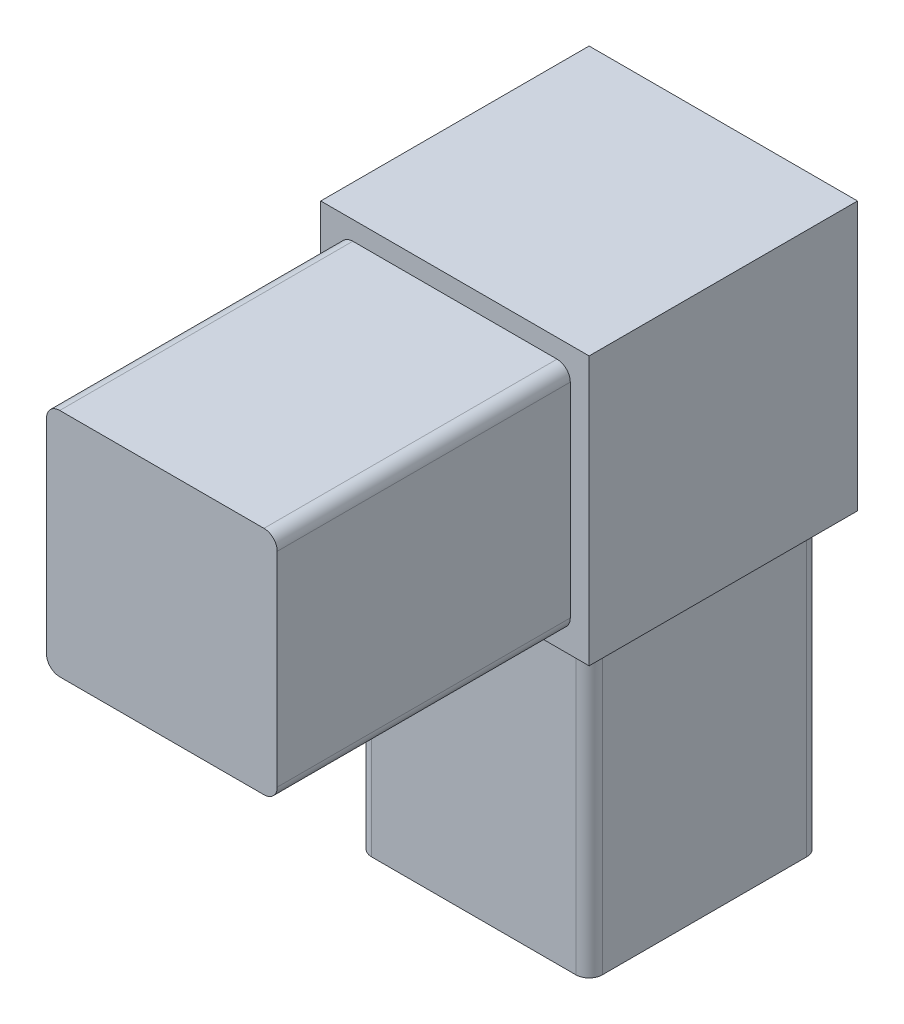
ISO-10303-21;
HEADER;
FILE_DESCRIPTION(('STEP AP214'),'2;1');
FILE_NAME('part.step','',(''),(''),'','','');
FILE_SCHEMA(('AUTOMOTIVE_DESIGN { 1 0 10303 214 1 1 1 1 }'));
ENDSEC;
DATA;
#1=APPLICATION_CONTEXT('core data for automotive mechanical design processes');
#2=APPLICATION_PROTOCOL_DEFINITION('international standard','automotive_design',2000,#1);
#3=PRODUCT_CONTEXT('',#1,'mechanical');
#4=PRODUCT('Part','Part','',(#3));
#5=PRODUCT_RELATED_PRODUCT_CATEGORY('part','',(#4));
#6=PRODUCT_DEFINITION_FORMATION('','',#4);
#7=PRODUCT_DEFINITION_CONTEXT('part definition',#1,'design');
#8=PRODUCT_DEFINITION('design','',#6,#7);
#9=PRODUCT_DEFINITION_SHAPE('','',#8);
#10=(LENGTH_UNIT() NAMED_UNIT(*) SI_UNIT(.MILLI.,.METRE.));
#11=(NAMED_UNIT(*) PLANE_ANGLE_UNIT() SI_UNIT($,.RADIAN.));
#12=(NAMED_UNIT(*) SI_UNIT($,.STERADIAN.) SOLID_ANGLE_UNIT());
#13=UNCERTAINTY_MEASURE_WITH_UNIT(LENGTH_MEASURE(1.E-05),#10,'distance_accuracy_value','');
#14=(GEOMETRIC_REPRESENTATION_CONTEXT(3) GLOBAL_UNCERTAINTY_ASSIGNED_CONTEXT((#13)) GLOBAL_UNIT_ASSIGNED_CONTEXT((#10,
#11,#12)) REPRESENTATION_CONTEXT('',''));
#15=CARTESIAN_POINT('',(0.,0.,0.));
#16=DIRECTION('',(0.,0.,1.));
#17=DIRECTION('',(1.,0.,0.));
#18=AXIS2_PLACEMENT_3D('',#15,#16,#17);
#19=CARTESIAN_POINT('',(-12.8524,53.7718,12.8524));
#20=DIRECTION('',(0.,0.,-1.));
#21=DIRECTION('',(-1.,0.,0.));
#22=AXIS2_PLACEMENT_3D('',#19,#20,#21);
#23=PLANE('',#22);
#24=DIRECTION('',(1.,0.,0.));
#25=VECTOR('',#24,1.);
#26=CARTESIAN_POINT('',(-12.8524,28.067,12.8524));
#27=LINE('',#26,#25);
#28=CARTESIAN_POINT('',(-12.8524,28.067,12.8524));
#29=VERTEX_POINT('',#28);
#30=CARTESIAN_POINT('',(12.8524,28.067,12.8524));
#31=VERTEX_POINT('',#30);
#32=EDGE_CURVE('E192',#29,#31,#27,.T.);
#33=ORIENTED_EDGE('',*,*,#32,.T.);
#34=DIRECTION('',(0.,-1.,0.));
#35=VECTOR('',#34,1.);
#36=CARTESIAN_POINT('',(12.8524,53.7718,12.8524));
#37=LINE('',#36,#35);
#38=CARTESIAN_POINT('',(12.8524,53.7718,12.8524));
#39=VERTEX_POINT('',#38);
#40=EDGE_CURVE('E412',#39,#31,#37,.T.);
#41=ORIENTED_EDGE('',*,*,#40,.F.);
#42=DIRECTION('',(1.,0.,0.));
#43=VECTOR('',#42,1.);
#44=CARTESIAN_POINT('',(-12.8524,53.7718,12.8524));
#45=LINE('',#44,#43);
#46=CARTESIAN_POINT('',(-12.8524,53.7718,12.8524));
#47=VERTEX_POINT('',#46);
#48=EDGE_CURVE('E188',#47,#39,#45,.T.);
#49=ORIENTED_EDGE('',*,*,#48,.F.);
#50=DIRECTION('',(0.,-1.,0.));
#51=VECTOR('',#50,1.);
#52=CARTESIAN_POINT('',(-12.8524,53.7718,12.8524));
#53=LINE('',#52,#51);
#54=EDGE_CURVE('E202',#47,#29,#53,.T.);
#55=ORIENTED_EDGE('',*,*,#54,.T.);
#56=EDGE_LOOP('',(#33,#41,#49,#55));
#57=FACE_BOUND('',#56,.T.);
#58=DIRECTION('',(0.,1.,0.));
#59=VECTOR('',#58,1.);
#60=CARTESIAN_POINT('',(11.049,29.8704,12.8524));
#61=LINE('',#60,#59);
#62=CARTESIAN_POINT('',(11.049,31.1404,12.8524));
#63=VERTEX_POINT('',#62);
#64=CARTESIAN_POINT('',(11.049,50.6984,12.8524));
#65=VERTEX_POINT('',#64);
#66=EDGE_CURVE('E399',#63,#65,#61,.T.);
#67=ORIENTED_EDGE('',*,*,#66,.F.);
#68=CARTESIAN_POINT('',(9.779,31.1404,12.8524));
#69=DIRECTION('',(0.,0.,-1.));
#70=DIRECTION('',(-1.,0.,0.));
#71=AXIS2_PLACEMENT_3D('',#68,#69,#70);
#72=CIRCLE('',#71,1.27);
#73=CARTESIAN_POINT('',(9.779,29.8704,12.8524));
#74=VERTEX_POINT('',#73);
#75=EDGE_CURVE('E280',#63,#74,#72,.T.);
#76=ORIENTED_EDGE('',*,*,#75,.T.);
#77=DIRECTION('',(1.,0.,0.));
#78=VECTOR('',#77,1.);
#79=CARTESIAN_POINT('',(-11.049,29.8704,12.8524));
#80=LINE('',#79,#78);
#81=CARTESIAN_POINT('',(-9.779,29.8704,12.8524));
#82=VERTEX_POINT('',#81);
#83=EDGE_CURVE('E407',#82,#74,#80,.T.);
#84=ORIENTED_EDGE('',*,*,#83,.F.);
#85=CARTESIAN_POINT('',(-9.779,31.1404,12.8524));
#86=DIRECTION('',(0.,0.,-1.));
#87=DIRECTION('',(-1.,0.,0.));
#88=AXIS2_PLACEMENT_3D('',#85,#86,#87);
#89=CIRCLE('',#88,1.27);
#90=CARTESIAN_POINT('',(-11.049,31.1404,12.8524));
#91=VERTEX_POINT('',#90);
#92=EDGE_CURVE('E284',#82,#91,#89,.T.);
#93=ORIENTED_EDGE('',*,*,#92,.T.);
#94=DIRECTION('',(0.,-1.,0.));
#95=VECTOR('',#94,1.);
#96=CARTESIAN_POINT('',(-11.049,29.8704,12.8524));
#97=LINE('',#96,#95);
#98=CARTESIAN_POINT('',(-11.049,50.6984,12.8524));
#99=VERTEX_POINT('',#98);
#100=EDGE_CURVE('E405',#99,#91,#97,.T.);
#101=ORIENTED_EDGE('',*,*,#100,.F.);
#102=CARTESIAN_POINT('',(-9.779,50.6984,12.8524));
#103=DIRECTION('',(0.,0.,-1.));
#104=DIRECTION('',(-1.,0.,0.));
#105=AXIS2_PLACEMENT_3D('',#102,#103,#104);
#106=CIRCLE('',#105,1.27);
#107=CARTESIAN_POINT('',(-9.779,51.9684,12.8524));
#108=VERTEX_POINT('',#107);
#109=EDGE_CURVE('E282',#99,#108,#106,.T.);
#110=ORIENTED_EDGE('',*,*,#109,.T.);
#111=DIRECTION('',(-1.,0.,0.));
#112=VECTOR('',#111,1.);
#113=CARTESIAN_POINT('',(-11.049,51.9684,12.8524));
#114=LINE('',#113,#112);
#115=CARTESIAN_POINT('',(9.779,51.9684,12.8524));
#116=VERTEX_POINT('',#115);
#117=EDGE_CURVE('E402',#116,#108,#114,.T.);
#118=ORIENTED_EDGE('',*,*,#117,.F.);
#119=CARTESIAN_POINT('',(9.779,50.6984,12.8524));
#120=DIRECTION('',(0.,0.,-1.));
#121=DIRECTION('',(-1.,0.,0.));
#122=AXIS2_PLACEMENT_3D('',#119,#120,#121);
#123=CIRCLE('',#122,1.27);
#124=EDGE_CURVE('E278',#116,#65,#123,.T.);
#125=ORIENTED_EDGE('',*,*,#124,.T.);
#126=EDGE_LOOP('',(#67,#76,#84,#93,#101,#110,#118,#125));
#127=FACE_BOUND('',#126,.T.);
#128=ADVANCED_FACE('F35',(#57,#127),#23,.F.);
#129=CARTESIAN_POINT('',(11.049,28.067,-11.049));
#130=DIRECTION('',(-1.,0.,0.));
#131=DIRECTION('',(0.,0.,1.));
#132=AXIS2_PLACEMENT_3D('',#129,#130,#131);
#133=PLANE('',#132);
#134=DIRECTION('',(0.,0.,-1.));
#135=VECTOR('',#134,1.);
#136=CARTESIAN_POINT('',(11.049,28.067,-11.049));
#137=LINE('',#136,#135);
#138=CARTESIAN_POINT('',(11.049,28.067,9.779));
#139=VERTEX_POINT('',#138);
#140=CARTESIAN_POINT('',(11.049,28.067,-9.779));
#141=VERTEX_POINT('',#140);
#142=EDGE_CURVE('E206',#139,#141,#137,.T.);
#143=ORIENTED_EDGE('',*,*,#142,.F.);
#144=DIRECTION('',(0.,-1.,0.));
#145=VECTOR('',#144,1.);
#146=CARTESIAN_POINT('',(11.049,28.067,9.779));
#147=LINE('',#146,#145);
#148=CARTESIAN_POINT('',(11.049,0.,9.779));
#149=VERTEX_POINT('',#148);
#150=EDGE_CURVE('E271',#139,#149,#147,.T.);
#151=ORIENTED_EDGE('',*,*,#150,.T.);
#152=DIRECTION('',(0.,0.,-1.));
#153=VECTOR('',#152,1.);
#154=CARTESIAN_POINT('',(11.049,0.,-11.049));
#155=LINE('',#154,#153);
#156=CARTESIAN_POINT('',(11.049,0.,-9.779));
#157=VERTEX_POINT('',#156);
#158=EDGE_CURVE('E197',#149,#157,#155,.T.);
#159=ORIENTED_EDGE('',*,*,#158,.T.);
#160=DIRECTION('',(0.,-1.,0.));
#161=VECTOR('',#160,1.);
#162=CARTESIAN_POINT('',(11.049,28.067,-9.779));
#163=LINE('',#162,#161);
#164=EDGE_CURVE('E269',#157,#141,#163,.F.);
#165=ORIENTED_EDGE('',*,*,#164,.T.);
#166=EDGE_LOOP('',(#143,#151,#159,#165));
#167=FACE_BOUND('',#166,.T.);
#168=ADVANCED_FACE('F311',(#167),#133,.F.);
#169=CARTESIAN_POINT('',(-11.049,28.067,-11.049));
#170=DIRECTION('',(0.,0.,1.));
#171=DIRECTION('',(1.,0.,0.));
#172=AXIS2_PLACEMENT_3D('',#169,#170,#171);
#173=PLANE('',#172);
#174=DIRECTION('',(-1.,0.,0.));
#175=VECTOR('',#174,1.);
#176=CARTESIAN_POINT('',(-11.049,0.,-11.049));
#177=LINE('',#176,#175);
#178=CARTESIAN_POINT('',(9.779,0.,-11.049));
#179=VERTEX_POINT('',#178);
#180=CARTESIAN_POINT('',(-9.779,0.,-11.049));
#181=VERTEX_POINT('',#180);
#182=EDGE_CURVE('E200',#179,#181,#177,.T.);
#183=ORIENTED_EDGE('',*,*,#182,.T.);
#184=DIRECTION('',(0.,-1.,0.));
#185=VECTOR('',#184,1.);
#186=CARTESIAN_POINT('',(-9.779,28.067,-11.049));
#187=LINE('',#186,#185);
#188=CARTESIAN_POINT('',(-9.779,28.067,-11.049));
#189=VERTEX_POINT('',#188);
#190=EDGE_CURVE('E50',#181,#189,#187,.F.);
#191=ORIENTED_EDGE('',*,*,#190,.T.);
#192=DIRECTION('',(-1.,0.,0.));
#193=VECTOR('',#192,1.);
#194=CARTESIAN_POINT('',(-11.049,28.067,-11.049));
#195=LINE('',#194,#193);
#196=CARTESIAN_POINT('',(9.779,28.067,-11.049));
#197=VERTEX_POINT('',#196);
#198=EDGE_CURVE('E208',#197,#189,#195,.T.);
#199=ORIENTED_EDGE('',*,*,#198,.F.);
#200=DIRECTION('',(0.,-1.,0.));
#201=VECTOR('',#200,1.);
#202=CARTESIAN_POINT('',(9.779,28.067,-11.049));
#203=LINE('',#202,#201);
#204=EDGE_CURVE('E274',#197,#179,#203,.T.);
#205=ORIENTED_EDGE('',*,*,#204,.T.);
#206=EDGE_LOOP('',(#183,#191,#199,#205));
#207=FACE_BOUND('',#206,.T.);
#208=ADVANCED_FACE('F304',(#207),#173,.F.);
#209=CARTESIAN_POINT('',(-11.049,28.067,-11.049));
#210=DIRECTION('',(1.,0.,0.));
#211=DIRECTION('',(0.,0.,-1.));
#212=AXIS2_PLACEMENT_3D('',#209,#210,#211);
#213=PLANE('',#212);
#214=DIRECTION('',(0.,0.,1.));
#215=VECTOR('',#214,1.);
#216=CARTESIAN_POINT('',(-11.049,0.,-11.049));
#217=LINE('',#216,#215);
#218=CARTESIAN_POINT('',(-11.049,0.,-9.779));
#219=VERTEX_POINT('',#218);
#220=CARTESIAN_POINT('',(-11.049,0.,9.779));
#221=VERTEX_POINT('',#220);
#222=EDGE_CURVE('E219',#219,#221,#217,.T.);
#223=ORIENTED_EDGE('',*,*,#222,.T.);
#224=DIRECTION('',(0.,-1.,0.));
#225=VECTOR('',#224,1.);
#226=CARTESIAN_POINT('',(-11.049,28.067,9.779));
#227=LINE('',#226,#225);
#228=CARTESIAN_POINT('',(-11.049,28.067,9.779));
#229=VERTEX_POINT('',#228);
#230=EDGE_CURVE('E267',#221,#229,#227,.F.);
#231=ORIENTED_EDGE('',*,*,#230,.T.);
#232=DIRECTION('',(0.,0.,1.));
#233=VECTOR('',#232,1.);
#234=CARTESIAN_POINT('',(-11.049,28.067,-11.049));
#235=LINE('',#234,#233);
#236=CARTESIAN_POINT('',(-11.049,28.067,-9.779));
#237=VERTEX_POINT('',#236);
#238=EDGE_CURVE('E211',#237,#229,#235,.T.);
#239=ORIENTED_EDGE('',*,*,#238,.F.);
#240=DIRECTION('',(0.,-1.,0.));
#241=VECTOR('',#240,1.);
#242=CARTESIAN_POINT('',(-11.049,28.067,-9.779));
#243=LINE('',#242,#241);
#244=EDGE_CURVE('E264',#237,#219,#243,.T.);
#245=ORIENTED_EDGE('',*,*,#244,.T.);
#246=EDGE_LOOP('',(#223,#231,#239,#245));
#247=FACE_BOUND('',#246,.T.);
#248=ADVANCED_FACE('F296',(#247),#213,.F.);
#249=CARTESIAN_POINT('',(-11.049,28.067,11.049));
#250=DIRECTION('',(0.,0.,-1.));
#251=DIRECTION('',(-1.,0.,0.));
#252=AXIS2_PLACEMENT_3D('',#249,#250,#251);
#253=PLANE('',#252);
#254=DIRECTION('',(1.,0.,0.));
#255=VECTOR('',#254,1.);
#256=CARTESIAN_POINT('',(-11.049,28.067,11.049));
#257=LINE('',#256,#255);
#258=CARTESIAN_POINT('',(-9.779,28.067,11.049));
#259=VERTEX_POINT('',#258);
#260=CARTESIAN_POINT('',(9.779,28.067,11.049));
#261=VERTEX_POINT('',#260);
#262=EDGE_CURVE('E214',#259,#261,#257,.T.);
#263=ORIENTED_EDGE('',*,*,#262,.F.);
#264=DIRECTION('',(0.,-1.,0.));
#265=VECTOR('',#264,1.);
#266=CARTESIAN_POINT('',(-9.779,28.067,11.049));
#267=LINE('',#266,#265);
#268=CARTESIAN_POINT('',(-9.779,0.,11.049));
#269=VERTEX_POINT('',#268);
#270=EDGE_CURVE('E253',#259,#269,#267,.T.);
#271=ORIENTED_EDGE('',*,*,#270,.T.);
#272=DIRECTION('',(1.,0.,0.));
#273=VECTOR('',#272,1.);
#274=CARTESIAN_POINT('',(-11.049,0.,11.049));
#275=LINE('',#274,#273);
#276=CARTESIAN_POINT('',(9.779,0.,11.049));
#277=VERTEX_POINT('',#276);
#278=EDGE_CURVE('E209',#269,#277,#275,.T.);
#279=ORIENTED_EDGE('',*,*,#278,.T.);
#280=DIRECTION('',(0.,-1.,0.));
#281=VECTOR('',#280,1.);
#282=CARTESIAN_POINT('',(9.779,28.067,11.049));
#283=LINE('',#282,#281);
#284=EDGE_CURVE('E251',#277,#261,#283,.F.);
#285=ORIENTED_EDGE('',*,*,#284,.T.);
#286=EDGE_LOOP('',(#263,#271,#279,#285));
#287=FACE_BOUND('',#286,.T.);
#288=ADVANCED_FACE('F319',(#287),#253,.F.);
#289=CARTESIAN_POINT('',(0.,0.,0.));
#290=DIRECTION('',(0.,1.,0.));
#291=DIRECTION('',(0.,0.,1.));
#292=AXIS2_PLACEMENT_3D('',#289,#290,#291);
#293=PLANE('',#292);
#294=ORIENTED_EDGE('',*,*,#278,.F.);
#295=CARTESIAN_POINT('',(-9.779,0.,9.779));
#296=DIRECTION('',(0.,1.,0.));
#297=DIRECTION('',(0.,0.,1.));
#298=AXIS2_PLACEMENT_3D('',#295,#296,#297);
#299=CIRCLE('',#298,1.27);
#300=EDGE_CURVE('E262',#269,#221,#299,.F.);
#301=ORIENTED_EDGE('',*,*,#300,.T.);
#302=ORIENTED_EDGE('',*,*,#222,.F.);
#303=CARTESIAN_POINT('',(-9.779,0.,-9.779));
#304=DIRECTION('',(0.,1.,0.));
#305=DIRECTION('',(0.,0.,1.));
#306=AXIS2_PLACEMENT_3D('',#303,#304,#305);
#307=CIRCLE('',#306,1.27);
#308=EDGE_CURVE('E258',#219,#181,#307,.F.);
#309=ORIENTED_EDGE('',*,*,#308,.T.);
#310=ORIENTED_EDGE('',*,*,#182,.F.);
#311=CARTESIAN_POINT('',(9.779,0.,-9.779));
#312=DIRECTION('',(0.,1.,0.));
#313=DIRECTION('',(0.,0.,1.));
#314=AXIS2_PLACEMENT_3D('',#311,#312,#313);
#315=CIRCLE('',#314,1.27);
#316=EDGE_CURVE('E256',#179,#157,#315,.F.);
#317=ORIENTED_EDGE('',*,*,#316,.T.);
#318=ORIENTED_EDGE('',*,*,#158,.F.);
#319=CARTESIAN_POINT('',(9.779,0.,9.779));
#320=DIRECTION('',(0.,1.,0.));
#321=DIRECTION('',(0.,0.,1.));
#322=AXIS2_PLACEMENT_3D('',#319,#320,#321);
#323=CIRCLE('',#322,1.27);
#324=EDGE_CURVE('E260',#149,#277,#323,.F.);
#325=ORIENTED_EDGE('',*,*,#324,.T.);
#326=EDGE_LOOP('',(#294,#301,#302,#309,#310,#317,#318,#325));
#327=FACE_BOUND('',#326,.T.);
#328=ADVANCED_FACE('F303',(#327),#293,.F.);
#329=CARTESIAN_POINT('',(0.,28.067,0.));
#330=DIRECTION('',(0.,-1.,0.));
#331=DIRECTION('',(0.,0.,-1.));
#332=AXIS2_PLACEMENT_3D('',#329,#330,#331);
#333=PLANE('',#332);
#334=DIRECTION('',(0.,0.,-1.));
#335=VECTOR('',#334,1.);
#336=CARTESIAN_POINT('',(12.8524,28.067,12.8524));
#337=LINE('',#336,#335);
#338=CARTESIAN_POINT('',(12.8524,28.067,-12.8524));
#339=VERTEX_POINT('',#338);
#340=EDGE_CURVE('E196',#31,#339,#337,.T.);
#341=ORIENTED_EDGE('',*,*,#340,.F.);
#342=ORIENTED_EDGE('',*,*,#32,.F.);
#343=DIRECTION('',(0.,0.,1.));
#344=VECTOR('',#343,1.);
#345=CARTESIAN_POINT('',(-12.8524,28.067,12.8524));
#346=LINE('',#345,#344);
#347=CARTESIAN_POINT('',(-12.8524,28.067,-12.8524));
#348=VERTEX_POINT('',#347);
#349=EDGE_CURVE('E416',#348,#29,#346,.T.);
#350=ORIENTED_EDGE('',*,*,#349,.F.);
#351=DIRECTION('',(-1.,0.,0.));
#352=VECTOR('',#351,1.);
#353=CARTESIAN_POINT('',(-12.8524,28.067,-12.8524));
#354=LINE('',#353,#352);
#355=EDGE_CURVE('E414',#339,#348,#354,.T.);
#356=ORIENTED_EDGE('',*,*,#355,.F.);
#357=EDGE_LOOP('',(#341,#342,#350,#356));
#358=FACE_BOUND('',#357,.T.);
#359=ORIENTED_EDGE('',*,*,#262,.T.);
#360=CARTESIAN_POINT('',(9.779,28.067,9.779));
#361=DIRECTION('',(0.,-1.,0.));
#362=DIRECTION('',(0.,0.,-1.));
#363=AXIS2_PLACEMENT_3D('',#360,#361,#362);
#364=CIRCLE('',#363,1.27);
#365=EDGE_CURVE('E288',#261,#139,#364,.F.);
#366=ORIENTED_EDGE('',*,*,#365,.T.);
#367=ORIENTED_EDGE('',*,*,#142,.T.);
#368=CARTESIAN_POINT('',(9.779,28.067,-9.779));
#369=DIRECTION('',(0.,-1.,0.));
#370=DIRECTION('',(0.,0.,-1.));
#371=AXIS2_PLACEMENT_3D('',#368,#369,#370);
#372=CIRCLE('',#371,1.27);
#373=EDGE_CURVE('E11',#141,#197,#372,.F.);
#374=ORIENTED_EDGE('',*,*,#373,.T.);
#375=ORIENTED_EDGE('',*,*,#198,.T.);
#376=CARTESIAN_POINT('',(-9.779,28.067,-9.779));
#377=DIRECTION('',(0.,-1.,0.));
#378=DIRECTION('',(0.,0.,-1.));
#379=AXIS2_PLACEMENT_3D('',#376,#377,#378);
#380=CIRCLE('',#379,1.27);
#381=EDGE_CURVE('E43',#189,#237,#380,.F.);
#382=ORIENTED_EDGE('',*,*,#381,.T.);
#383=ORIENTED_EDGE('',*,*,#238,.T.);
#384=CARTESIAN_POINT('',(-9.779,28.067,9.779));
#385=DIRECTION('',(0.,-1.,0.));
#386=DIRECTION('',(0.,0.,-1.));
#387=AXIS2_PLACEMENT_3D('',#384,#385,#386);
#388=CIRCLE('',#387,1.27);
#389=EDGE_CURVE('E286',#229,#259,#388,.F.);
#390=ORIENTED_EDGE('',*,*,#389,.T.);
#391=EDGE_LOOP('',(#359,#366,#367,#374,#375,#382,#383,#390));
#392=FACE_BOUND('',#391,.T.);
#393=ADVANCED_FACE('F291',(#358,#392),#333,.T.);
#394=CARTESIAN_POINT('',(12.8524,53.7718,12.8524));
#395=DIRECTION('',(-1.,0.,0.));
#396=DIRECTION('',(0.,0.,1.));
#397=AXIS2_PLACEMENT_3D('',#394,#395,#396);
#398=PLANE('',#397);
#399=ORIENTED_EDGE('',*,*,#340,.T.);
#400=DIRECTION('',(0.,-1.,0.));
#401=VECTOR('',#400,1.);
#402=CARTESIAN_POINT('',(12.8524,53.7718,-12.8524));
#403=LINE('',#402,#401);
#404=CARTESIAN_POINT('',(12.8524,53.7718,-12.8524));
#405=VERTEX_POINT('',#404);
#406=EDGE_CURVE('E176',#405,#339,#403,.T.);
#407=ORIENTED_EDGE('',*,*,#406,.F.);
#408=DIRECTION('',(0.,0.,-1.));
#409=VECTOR('',#408,1.);
#410=CARTESIAN_POINT('',(12.8524,53.7718,12.8524));
#411=LINE('',#410,#409);
#412=EDGE_CURVE('E183',#39,#405,#411,.T.);
#413=ORIENTED_EDGE('',*,*,#412,.F.);
#414=ORIENTED_EDGE('',*,*,#40,.T.);
#415=EDGE_LOOP('',(#399,#407,#413,#414));
#416=FACE_BOUND('',#415,.T.);
#417=ADVANCED_FACE('F194',(#416),#398,.F.);
#418=CARTESIAN_POINT('',(-12.8524,53.7718,-12.8524));
#419=DIRECTION('',(0.,0.,1.));
#420=DIRECTION('',(1.,0.,0.));
#421=AXIS2_PLACEMENT_3D('',#418,#419,#420);
#422=PLANE('',#421);
#423=ORIENTED_EDGE('',*,*,#355,.T.);
#424=DIRECTION('',(0.,-1.,0.));
#425=VECTOR('',#424,1.);
#426=CARTESIAN_POINT('',(-12.8524,53.7718,-12.8524));
#427=LINE('',#426,#425);
#428=CARTESIAN_POINT('',(-12.8524,53.7718,-12.8524));
#429=VERTEX_POINT('',#428);
#430=EDGE_CURVE('E179',#429,#348,#427,.T.);
#431=ORIENTED_EDGE('',*,*,#430,.F.);
#432=DIRECTION('',(-1.,0.,0.));
#433=VECTOR('',#432,1.);
#434=CARTESIAN_POINT('',(-12.8524,53.7718,-12.8524));
#435=LINE('',#434,#433);
#436=EDGE_CURVE('E172',#405,#429,#435,.T.);
#437=ORIENTED_EDGE('',*,*,#436,.F.);
#438=ORIENTED_EDGE('',*,*,#406,.T.);
#439=EDGE_LOOP('',(#423,#431,#437,#438));
#440=FACE_BOUND('',#439,.T.);
#441=ADVANCED_FACE('F174',(#440),#422,.F.);
#442=CARTESIAN_POINT('',(-12.8524,53.7718,12.8524));
#443=DIRECTION('',(1.,0.,0.));
#444=DIRECTION('',(0.,0.,-1.));
#445=AXIS2_PLACEMENT_3D('',#442,#443,#444);
#446=PLANE('',#445);
#447=ORIENTED_EDGE('',*,*,#349,.T.);
#448=ORIENTED_EDGE('',*,*,#54,.F.);
#449=DIRECTION('',(0.,0.,1.));
#450=VECTOR('',#449,1.);
#451=CARTESIAN_POINT('',(-12.8524,53.7718,12.8524));
#452=LINE('',#451,#450);
#453=EDGE_CURVE('E182',#429,#47,#452,.T.);
#454=ORIENTED_EDGE('',*,*,#453,.F.);
#455=ORIENTED_EDGE('',*,*,#430,.T.);
#456=EDGE_LOOP('',(#447,#448,#454,#455));
#457=FACE_BOUND('',#456,.T.);
#458=ADVANCED_FACE('F345',(#457),#446,.F.);
#459=CARTESIAN_POINT('',(0.,53.7718,0.));
#460=DIRECTION('',(0.,-1.,0.));
#461=DIRECTION('',(0.,0.,-1.));
#462=AXIS2_PLACEMENT_3D('',#459,#460,#461);
#463=PLANE('',#462);
#464=ORIENTED_EDGE('',*,*,#412,.T.);
#465=ORIENTED_EDGE('',*,*,#436,.T.);
#466=ORIENTED_EDGE('',*,*,#453,.T.);
#467=ORIENTED_EDGE('',*,*,#48,.T.);
#468=EDGE_LOOP('',(#464,#465,#466,#467));
#469=FACE_BOUND('',#468,.T.);
#470=ADVANCED_FACE('F186',(#469),#463,.F.);
#471=CARTESIAN_POINT('',(11.049,29.8704,40.9194));
#472=DIRECTION('',(-1.,0.,0.));
#473=DIRECTION('',(0.,0.,1.));
#474=AXIS2_PLACEMENT_3D('',#471,#472,#473);
#475=PLANE('',#474);
#476=ORIENTED_EDGE('',*,*,#66,.T.);
#477=DIRECTION('',(0.,0.,-1.));
#478=VECTOR('',#477,1.);
#479=CARTESIAN_POINT('',(11.049,50.6984,40.9194));
#480=LINE('',#479,#478);
#481=CARTESIAN_POINT('',(11.049,50.6984,40.9194));
#482=VERTEX_POINT('',#481);
#483=EDGE_CURVE('E231',#65,#482,#480,.F.);
#484=ORIENTED_EDGE('',*,*,#483,.T.);
#485=DIRECTION('',(0.,1.,0.));
#486=VECTOR('',#485,1.);
#487=CARTESIAN_POINT('',(11.049,29.8704,40.9194));
#488=LINE('',#487,#486);
#489=CARTESIAN_POINT('',(11.049,31.1404,40.9194));
#490=VERTEX_POINT('',#489);
#491=EDGE_CURVE('E395',#490,#482,#488,.T.);
#492=ORIENTED_EDGE('',*,*,#491,.F.);
#493=DIRECTION('',(0.,0.,-1.));
#494=VECTOR('',#493,1.);
#495=CARTESIAN_POINT('',(11.049,31.1404,40.9194));
#496=LINE('',#495,#494);
#497=EDGE_CURVE('E228',#490,#63,#496,.T.);
#498=ORIENTED_EDGE('',*,*,#497,.T.);
#499=EDGE_LOOP('',(#476,#484,#492,#498));
#500=FACE_BOUND('',#499,.T.);
#501=ADVANCED_FACE('F449',(#500),#475,.F.);
#502=CARTESIAN_POINT('',(-11.049,51.9684,40.9194));
#503=DIRECTION('',(0.,-1.,0.));
#504=DIRECTION('',(0.,0.,-1.));
#505=AXIS2_PLACEMENT_3D('',#502,#503,#504);
#506=PLANE('',#505);
#507=DIRECTION('',(-1.,0.,0.));
#508=VECTOR('',#507,1.);
#509=CARTESIAN_POINT('',(-11.049,51.9684,40.9194));
#510=LINE('',#509,#508);
#511=CARTESIAN_POINT('',(9.779,51.9684,40.9194));
#512=VERTEX_POINT('',#511);
#513=CARTESIAN_POINT('',(-9.779,51.9684,40.9194));
#514=VERTEX_POINT('',#513);
#515=EDGE_CURVE('E385',#512,#514,#510,.T.);
#516=ORIENTED_EDGE('',*,*,#515,.F.);
#517=DIRECTION('',(0.,0.,-1.));
#518=VECTOR('',#517,1.);
#519=CARTESIAN_POINT('',(9.779,51.9684,40.9194));
#520=LINE('',#519,#518);
#521=EDGE_CURVE('E225',#512,#116,#520,.T.);
#522=ORIENTED_EDGE('',*,*,#521,.T.);
#523=ORIENTED_EDGE('',*,*,#117,.T.);
#524=DIRECTION('',(0.,0.,-1.));
#525=VECTOR('',#524,1.);
#526=CARTESIAN_POINT('',(-9.779,51.9684,40.9194));
#527=LINE('',#526,#525);
#528=EDGE_CURVE('E216',#108,#514,#527,.F.);
#529=ORIENTED_EDGE('',*,*,#528,.T.);
#530=EDGE_LOOP('',(#516,#522,#523,#529));
#531=FACE_BOUND('',#530,.T.);
#532=ADVANCED_FACE('F456',(#531),#506,.F.);
#533=CARTESIAN_POINT('',(-11.049,29.8704,40.9194));
#534=DIRECTION('',(1.,0.,0.));
#535=DIRECTION('',(0.,0.,-1.));
#536=AXIS2_PLACEMENT_3D('',#533,#534,#535);
#537=PLANE('',#536);
#538=DIRECTION('',(0.,-1.,0.));
#539=VECTOR('',#538,1.);
#540=CARTESIAN_POINT('',(-11.049,29.8704,40.9194));
#541=LINE('',#540,#539);
#542=CARTESIAN_POINT('',(-11.049,50.6984,40.9194));
#543=VERTEX_POINT('',#542);
#544=CARTESIAN_POINT('',(-11.049,31.1404,40.9194));
#545=VERTEX_POINT('',#544);
#546=EDGE_CURVE('E382',#543,#545,#541,.T.);
#547=ORIENTED_EDGE('',*,*,#546,.F.);
#548=DIRECTION('',(0.,0.,-1.));
#549=VECTOR('',#548,1.);
#550=CARTESIAN_POINT('',(-11.049,50.6984,40.9194));
#551=LINE('',#550,#549);
#552=EDGE_CURVE('E248',#543,#99,#551,.T.);
#553=ORIENTED_EDGE('',*,*,#552,.T.);
#554=ORIENTED_EDGE('',*,*,#100,.T.);
#555=DIRECTION('',(0.,0.,-1.));
#556=VECTOR('',#555,1.);
#557=CARTESIAN_POINT('',(-11.049,31.1404,40.9194));
#558=LINE('',#557,#556);
#559=EDGE_CURVE('E246',#91,#545,#558,.F.);
#560=ORIENTED_EDGE('',*,*,#559,.T.);
#561=EDGE_LOOP('',(#547,#553,#554,#560));
#562=FACE_BOUND('',#561,.T.);
#563=ADVANCED_FACE('F387',(#562),#537,.F.);
#564=CARTESIAN_POINT('',(-11.049,29.8704,40.9194));
#565=DIRECTION('',(0.,1.,0.));
#566=DIRECTION('',(0.,0.,1.));
#567=AXIS2_PLACEMENT_3D('',#564,#565,#566);
#568=PLANE('',#567);
#569=ORIENTED_EDGE('',*,*,#83,.T.);
#570=DIRECTION('',(0.,0.,-1.));
#571=VECTOR('',#570,1.);
#572=CARTESIAN_POINT('',(9.779,29.8704,40.9194));
#573=LINE('',#572,#571);
#574=CARTESIAN_POINT('',(9.779,29.8704,40.9194));
#575=VERTEX_POINT('',#574);
#576=EDGE_CURVE('E244',#74,#575,#573,.F.);
#577=ORIENTED_EDGE('',*,*,#576,.T.);
#578=DIRECTION('',(1.,0.,0.));
#579=VECTOR('',#578,1.);
#580=CARTESIAN_POINT('',(-11.049,29.8704,40.9194));
#581=LINE('',#580,#579);
#582=CARTESIAN_POINT('',(-9.779,29.8704,40.9194));
#583=VERTEX_POINT('',#582);
#584=EDGE_CURVE('E391',#583,#575,#581,.T.);
#585=ORIENTED_EDGE('',*,*,#584,.F.);
#586=DIRECTION('',(0.,0.,-1.));
#587=VECTOR('',#586,1.);
#588=CARTESIAN_POINT('',(-9.779,29.8704,40.9194));
#589=LINE('',#588,#587);
#590=EDGE_CURVE('E241',#583,#82,#589,.T.);
#591=ORIENTED_EDGE('',*,*,#590,.T.);
#592=EDGE_LOOP('',(#569,#577,#585,#591));
#593=FACE_BOUND('',#592,.T.);
#594=ADVANCED_FACE('F471',(#593),#568,.F.);
#595=CARTESIAN_POINT('',(0.,0.,40.9194));
#596=DIRECTION('',(0.,0.,-1.));
#597=DIRECTION('',(-1.,0.,0.));
#598=AXIS2_PLACEMENT_3D('',#595,#596,#597);
#599=PLANE('',#598);
#600=ORIENTED_EDGE('',*,*,#491,.T.);
#601=CARTESIAN_POINT('',(9.779,50.6984,40.9194));
#602=DIRECTION('',(0.,0.,-1.));
#603=DIRECTION('',(-1.,0.,0.));
#604=AXIS2_PLACEMENT_3D('',#601,#602,#603);
#605=CIRCLE('',#604,1.27);
#606=EDGE_CURVE('E239',#482,#512,#605,.F.);
#607=ORIENTED_EDGE('',*,*,#606,.T.);
#608=ORIENTED_EDGE('',*,*,#515,.T.);
#609=CARTESIAN_POINT('',(-9.779,50.6984,40.9194));
#610=DIRECTION('',(0.,0.,-1.));
#611=DIRECTION('',(-1.,0.,0.));
#612=AXIS2_PLACEMENT_3D('',#609,#610,#611);
#613=CIRCLE('',#612,1.27);
#614=EDGE_CURVE('E235',#514,#543,#613,.F.);
#615=ORIENTED_EDGE('',*,*,#614,.T.);
#616=ORIENTED_EDGE('',*,*,#546,.T.);
#617=CARTESIAN_POINT('',(-9.779,31.1404,40.9194));
#618=DIRECTION('',(0.,0.,-1.));
#619=DIRECTION('',(-1.,0.,0.));
#620=AXIS2_PLACEMENT_3D('',#617,#618,#619);
#621=CIRCLE('',#620,1.27);
#622=EDGE_CURVE('E233',#545,#583,#621,.F.);
#623=ORIENTED_EDGE('',*,*,#622,.T.);
#624=ORIENTED_EDGE('',*,*,#584,.T.);
#625=CARTESIAN_POINT('',(9.779,31.1404,40.9194));
#626=DIRECTION('',(0.,0.,-1.));
#627=DIRECTION('',(-1.,0.,0.));
#628=AXIS2_PLACEMENT_3D('',#625,#626,#627);
#629=CIRCLE('',#628,1.27);
#630=EDGE_CURVE('E237',#575,#490,#629,.F.);
#631=ORIENTED_EDGE('',*,*,#630,.T.);
#632=EDGE_LOOP('',(#600,#607,#608,#615,#616,#623,#624,#631));
#633=FACE_BOUND('',#632,.T.);
#634=ADVANCED_FACE('F365',(#633),#599,.F.);
#635=CARTESIAN_POINT('',(9.779,50.6984,40.9194));
#636=DIRECTION('',(0.,0.,-1.));
#637=DIRECTION('',(-1.,0.,0.));
#638=AXIS2_PLACEMENT_3D('',#635,#636,#637);
#639=CYLINDRICAL_SURFACE('',#638,1.27);
#640=ORIENTED_EDGE('',*,*,#606,.F.);
#641=ORIENTED_EDGE('',*,*,#483,.F.);
#642=ORIENTED_EDGE('',*,*,#124,.F.);
#643=ORIENTED_EDGE('',*,*,#521,.F.);
#644=EDGE_LOOP('',(#640,#641,#642,#643));
#645=FACE_BOUND('',#644,.T.);
#646=ADVANCED_FACE('F361',(#645),#639,.T.);
#647=CARTESIAN_POINT('',(9.779,31.1404,40.9194));
#648=DIRECTION('',(0.,0.,-1.));
#649=DIRECTION('',(-1.,0.,0.));
#650=AXIS2_PLACEMENT_3D('',#647,#648,#649);
#651=CYLINDRICAL_SURFACE('',#650,1.27);
#652=ORIENTED_EDGE('',*,*,#630,.F.);
#653=ORIENTED_EDGE('',*,*,#576,.F.);
#654=ORIENTED_EDGE('',*,*,#75,.F.);
#655=ORIENTED_EDGE('',*,*,#497,.F.);
#656=EDGE_LOOP('',(#652,#653,#654,#655));
#657=FACE_BOUND('',#656,.T.);
#658=ADVANCED_FACE('F364',(#657),#651,.T.);
#659=CARTESIAN_POINT('',(-9.779,50.6984,40.9194));
#660=DIRECTION('',(0.,0.,-1.));
#661=DIRECTION('',(-1.,0.,0.));
#662=AXIS2_PLACEMENT_3D('',#659,#660,#661);
#663=CYLINDRICAL_SURFACE('',#662,1.27);
#664=ORIENTED_EDGE('',*,*,#614,.F.);
#665=ORIENTED_EDGE('',*,*,#528,.F.);
#666=ORIENTED_EDGE('',*,*,#109,.F.);
#667=ORIENTED_EDGE('',*,*,#552,.F.);
#668=EDGE_LOOP('',(#664,#665,#666,#667));
#669=FACE_BOUND('',#668,.T.);
#670=ADVANCED_FACE('F331',(#669),#663,.T.);
#671=CARTESIAN_POINT('',(-9.779,31.1404,40.9194));
#672=DIRECTION('',(0.,0.,-1.));
#673=DIRECTION('',(-1.,0.,0.));
#674=AXIS2_PLACEMENT_3D('',#671,#672,#673);
#675=CYLINDRICAL_SURFACE('',#674,1.27);
#676=ORIENTED_EDGE('',*,*,#622,.F.);
#677=ORIENTED_EDGE('',*,*,#559,.F.);
#678=ORIENTED_EDGE('',*,*,#92,.F.);
#679=ORIENTED_EDGE('',*,*,#590,.F.);
#680=EDGE_LOOP('',(#676,#677,#678,#679));
#681=FACE_BOUND('',#680,.T.);
#682=ADVANCED_FACE('F324',(#681),#675,.T.);
#683=CARTESIAN_POINT('',(-9.779,28.067,9.779));
#684=DIRECTION('',(0.,-1.,0.));
#685=DIRECTION('',(0.,0.,-1.));
#686=AXIS2_PLACEMENT_3D('',#683,#684,#685);
#687=CYLINDRICAL_SURFACE('',#686,1.27);
#688=ORIENTED_EDGE('',*,*,#389,.F.);
#689=ORIENTED_EDGE('',*,*,#230,.F.);
#690=ORIENTED_EDGE('',*,*,#300,.F.);
#691=ORIENTED_EDGE('',*,*,#270,.F.);
#692=EDGE_LOOP('',(#688,#689,#690,#691));
#693=FACE_BOUND('',#692,.T.);
#694=ADVANCED_FACE('F322',(#693),#687,.T.);
#695=CARTESIAN_POINT('',(9.779,28.067,9.779));
#696=DIRECTION('',(0.,-1.,0.));
#697=DIRECTION('',(0.,0.,-1.));
#698=AXIS2_PLACEMENT_3D('',#695,#696,#697);
#699=CYLINDRICAL_SURFACE('',#698,1.27);
#700=ORIENTED_EDGE('',*,*,#365,.F.);
#701=ORIENTED_EDGE('',*,*,#284,.F.);
#702=ORIENTED_EDGE('',*,*,#324,.F.);
#703=ORIENTED_EDGE('',*,*,#150,.F.);
#704=EDGE_LOOP('',(#700,#701,#702,#703));
#705=FACE_BOUND('',#704,.T.);
#706=ADVANCED_FACE('F315',(#705),#699,.T.);
#707=CARTESIAN_POINT('',(-9.779,28.067,-9.779));
#708=DIRECTION('',(0.,-1.,0.));
#709=DIRECTION('',(0.,0.,-1.));
#710=AXIS2_PLACEMENT_3D('',#707,#708,#709);
#711=CYLINDRICAL_SURFACE('',#710,1.27);
#712=ORIENTED_EDGE('',*,*,#381,.F.);
#713=ORIENTED_EDGE('',*,*,#190,.F.);
#714=ORIENTED_EDGE('',*,*,#308,.F.);
#715=ORIENTED_EDGE('',*,*,#244,.F.);
#716=EDGE_LOOP('',(#712,#713,#714,#715));
#717=FACE_BOUND('',#716,.T.);
#718=ADVANCED_FACE('F299',(#717),#711,.T.);
#719=CARTESIAN_POINT('',(9.779,28.067,-9.779));
#720=DIRECTION('',(0.,-1.,0.));
#721=DIRECTION('',(0.,0.,-1.));
#722=AXIS2_PLACEMENT_3D('',#719,#720,#721);
#723=CYLINDRICAL_SURFACE('',#722,1.27);
#724=ORIENTED_EDGE('',*,*,#373,.F.);
#725=ORIENTED_EDGE('',*,*,#164,.F.);
#726=ORIENTED_EDGE('',*,*,#316,.F.);
#727=ORIENTED_EDGE('',*,*,#204,.F.);
#728=EDGE_LOOP('',(#724,#725,#726,#727));
#729=FACE_BOUND('',#728,.T.);
#730=ADVANCED_FACE('F37',(#729),#723,.T.);
#731=CLOSED_SHELL('',(#128,#168,#208,#248,#288,#328,#393,#417,#441,#458,#470,#501,#532,#563,
#594,#634,#646,#658,#670,#682,#694,#706,#718,#730));
#732=MANIFOLD_SOLID_BREP('B2',#731);
#733=ADVANCED_BREP_SHAPE_REPRESENTATION('',(#18,#732),#14);
#734=SHAPE_DEFINITION_REPRESENTATION(#9,#733);
ENDSEC;
END-ISO-10303-21;
